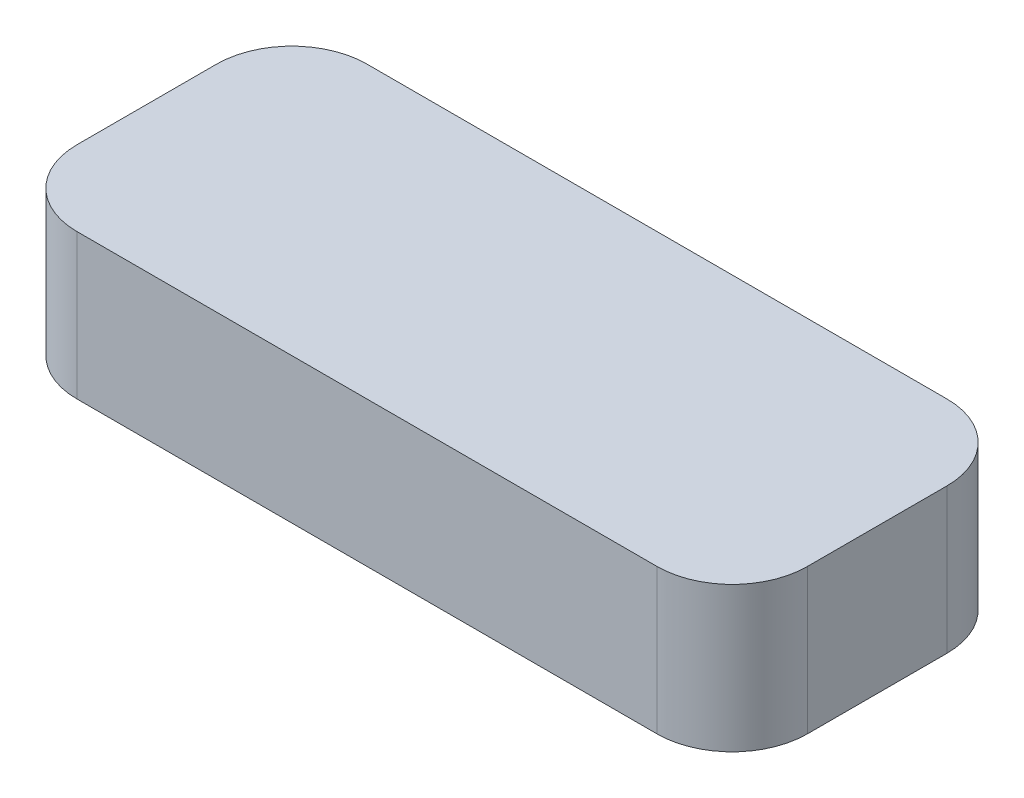
ISO-10303-21;
HEADER;
FILE_DESCRIPTION(('STEP AP214'),'2;1');
FILE_NAME('part.step','',(''),(''),'','','');
FILE_SCHEMA(('AUTOMOTIVE_DESIGN { 1 0 10303 214 1 1 1 1 }'));
ENDSEC;
DATA;
#1=APPLICATION_CONTEXT('core data for automotive mechanical design processes');
#2=APPLICATION_PROTOCOL_DEFINITION('international standard','automotive_design',2000,#1);
#3=PRODUCT_CONTEXT('',#1,'mechanical');
#4=PRODUCT('Part','Part','',(#3));
#5=PRODUCT_RELATED_PRODUCT_CATEGORY('part','',(#4));
#6=PRODUCT_DEFINITION_FORMATION('','',#4);
#7=PRODUCT_DEFINITION_CONTEXT('part definition',#1,'design');
#8=PRODUCT_DEFINITION('design','',#6,#7);
#9=PRODUCT_DEFINITION_SHAPE('','',#8);
#10=(LENGTH_UNIT() NAMED_UNIT(*) SI_UNIT(.MILLI.,.METRE.));
#11=(NAMED_UNIT(*) PLANE_ANGLE_UNIT() SI_UNIT($,.RADIAN.));
#12=(NAMED_UNIT(*) SI_UNIT($,.STERADIAN.) SOLID_ANGLE_UNIT());
#13=UNCERTAINTY_MEASURE_WITH_UNIT(LENGTH_MEASURE(1.E-05),#10,'distance_accuracy_value','');
#14=(GEOMETRIC_REPRESENTATION_CONTEXT(3) GLOBAL_UNCERTAINTY_ASSIGNED_CONTEXT((#13)) GLOBAL_UNIT_ASSIGNED_CONTEXT((#10,
#11,#12)) REPRESENTATION_CONTEXT('',''));
#15=CARTESIAN_POINT('',(0.,0.,0.));
#16=DIRECTION('',(0.,0.,1.));
#17=DIRECTION('',(1.,0.,0.));
#18=AXIS2_PLACEMENT_3D('',#15,#16,#17);
#19=CARTESIAN_POINT('',(215.9,85.725,85.725));
#20=DIRECTION('',(-1.,0.,0.));
#21=DIRECTION('',(0.,0.,1.));
#22=AXIS2_PLACEMENT_3D('',#19,#20,#21);
#23=PLANE('',#22);
#24=DIRECTION('',(0.,0.,-1.));
#25=VECTOR('',#24,1.);
#26=CARTESIAN_POINT('',(215.9,0.,85.725));
#27=LINE('',#26,#25);
#28=CARTESIAN_POINT('',(215.9,0.,41.275));
#29=VERTEX_POINT('',#28);
#30=CARTESIAN_POINT('',(215.9,0.,-41.275));
#31=VERTEX_POINT('',#30);
#32=EDGE_CURVE('E232',#29,#31,#27,.T.);
#33=ORIENTED_EDGE('',*,*,#32,.T.);
#34=DIRECTION('',(0.,-1.,0.));
#35=VECTOR('',#34,1.);
#36=CARTESIAN_POINT('',(215.9,85.725,-41.275));
#37=LINE('',#36,#35);
#38=CARTESIAN_POINT('',(215.9,85.725,-41.275));
#39=VERTEX_POINT('',#38);
#40=EDGE_CURVE('E285',#31,#39,#37,.F.);
#41=ORIENTED_EDGE('',*,*,#40,.T.);
#42=DIRECTION('',(0.,0.,-1.));
#43=VECTOR('',#42,1.);
#44=CARTESIAN_POINT('',(215.9,85.725,85.725));
#45=LINE('',#44,#43);
#46=CARTESIAN_POINT('',(215.9,85.725,41.275));
#47=VERTEX_POINT('',#46);
#48=EDGE_CURVE('E234',#47,#39,#45,.T.);
#49=ORIENTED_EDGE('',*,*,#48,.F.);
#50=DIRECTION('',(0.,-1.,0.));
#51=VECTOR('',#50,1.);
#52=CARTESIAN_POINT('',(215.9,85.725,41.275));
#53=LINE('',#52,#51);
#54=EDGE_CURVE('E281',#47,#29,#53,.T.);
#55=ORIENTED_EDGE('',*,*,#54,.T.);
#56=EDGE_LOOP('',(#33,#41,#49,#55));
#57=FACE_BOUND('',#56,.T.);
#58=ADVANCED_FACE('F42',(#57),#23,.F.);
#59=CARTESIAN_POINT('',(-215.9,85.725,-85.725));
#60=DIRECTION('',(0.,0.,1.));
#61=DIRECTION('',(1.,0.,0.));
#62=AXIS2_PLACEMENT_3D('',#59,#60,#61);
#63=PLANE('',#62);
#64=DIRECTION('',(-1.,0.,0.));
#65=VECTOR('',#64,1.);
#66=CARTESIAN_POINT('',(-215.9,85.725,-85.725));
#67=LINE('',#66,#65);
#68=CARTESIAN_POINT('',(171.45,85.725,-85.725));
#69=VERTEX_POINT('',#68);
#70=CARTESIAN_POINT('',(-171.45,85.725,-85.725));
#71=VERTEX_POINT('',#70);
#72=EDGE_CURVE('E238',#69,#71,#67,.T.);
#73=ORIENTED_EDGE('',*,*,#72,.F.);
#74=DIRECTION('',(0.,-1.,0.));
#75=VECTOR('',#74,1.);
#76=CARTESIAN_POINT('',(171.45,85.725,-85.725));
#77=LINE('',#76,#75);
#78=CARTESIAN_POINT('',(171.45,0.,-85.725));
#79=VERTEX_POINT('',#78);
#80=EDGE_CURVE('E265',#69,#79,#77,.T.);
#81=ORIENTED_EDGE('',*,*,#80,.T.);
#82=DIRECTION('',(-1.,0.,0.));
#83=VECTOR('',#82,1.);
#84=CARTESIAN_POINT('',(-215.9,0.,-85.725));
#85=LINE('',#84,#83);
#86=CARTESIAN_POINT('',(-171.45,0.,-85.725));
#87=VERTEX_POINT('',#86);
#88=EDGE_CURVE('E253',#79,#87,#85,.T.);
#89=ORIENTED_EDGE('',*,*,#88,.T.);
#90=DIRECTION('',(0.,-1.,0.));
#91=VECTOR('',#90,1.);
#92=CARTESIAN_POINT('',(-171.45,85.725,-85.725));
#93=LINE('',#92,#91);
#94=EDGE_CURVE('E249',#87,#71,#93,.F.);
#95=ORIENTED_EDGE('',*,*,#94,.T.);
#96=EDGE_LOOP('',(#73,#81,#89,#95));
#97=FACE_BOUND('',#96,.T.);
#98=ADVANCED_FACE('F336',(#97),#63,.F.);
#99=CARTESIAN_POINT('',(-215.9,85.725,85.725));
#100=DIRECTION('',(1.,0.,0.));
#101=DIRECTION('',(0.,0.,-1.));
#102=AXIS2_PLACEMENT_3D('',#99,#100,#101);
#103=PLANE('',#102);
#104=DIRECTION('',(0.,0.,1.));
#105=VECTOR('',#104,1.);
#106=CARTESIAN_POINT('',(-215.9,0.,85.725));
#107=LINE('',#106,#105);
#108=CARTESIAN_POINT('',(-215.9,0.,-41.275));
#109=VERTEX_POINT('',#108);
#110=CARTESIAN_POINT('',(-215.9,0.,41.275));
#111=VERTEX_POINT('',#110);
#112=EDGE_CURVE('E257',#109,#111,#107,.T.);
#113=ORIENTED_EDGE('',*,*,#112,.T.);
#114=DIRECTION('',(0.,-1.,0.));
#115=VECTOR('',#114,1.);
#116=CARTESIAN_POINT('',(-215.9,85.725,41.275));
#117=LINE('',#116,#115);
#118=CARTESIAN_POINT('',(-215.9,85.725,41.275));
#119=VERTEX_POINT('',#118);
#120=EDGE_CURVE('E12',#111,#119,#117,.F.);
#121=ORIENTED_EDGE('',*,*,#120,.T.);
#122=DIRECTION('',(0.,0.,1.));
#123=VECTOR('',#122,1.);
#124=CARTESIAN_POINT('',(-215.9,85.725,85.725));
#125=LINE('',#124,#123);
#126=CARTESIAN_POINT('',(-215.9,85.725,-41.275));
#127=VERTEX_POINT('',#126);
#128=EDGE_CURVE('E243',#127,#119,#125,.T.);
#129=ORIENTED_EDGE('',*,*,#128,.F.);
#130=DIRECTION('',(0.,-1.,0.));
#131=VECTOR('',#130,1.);
#132=CARTESIAN_POINT('',(-215.9,85.725,-41.275));
#133=LINE('',#132,#131);
#134=EDGE_CURVE('E51',#127,#109,#133,.T.);
#135=ORIENTED_EDGE('',*,*,#134,.T.);
#136=EDGE_LOOP('',(#113,#121,#129,#135));
#137=FACE_BOUND('',#136,.T.);
#138=ADVANCED_FACE('F311',(#137),#103,.F.);
#139=CARTESIAN_POINT('',(-215.9,85.725,85.725));
#140=DIRECTION('',(0.,0.,-1.));
#141=DIRECTION('',(-1.,0.,0.));
#142=AXIS2_PLACEMENT_3D('',#139,#140,#141);
#143=PLANE('',#142);
#144=DIRECTION('',(1.,0.,0.));
#145=VECTOR('',#144,1.);
#146=CARTESIAN_POINT('',(-215.9,0.,85.725));
#147=LINE('',#146,#145);
#148=CARTESIAN_POINT('',(-171.45,0.,85.725));
#149=VERTEX_POINT('',#148);
#150=CARTESIAN_POINT('',(171.45,0.,85.725));
#151=VERTEX_POINT('',#150);
#152=EDGE_CURVE('E239',#149,#151,#147,.T.);
#153=ORIENTED_EDGE('',*,*,#152,.T.);
#154=DIRECTION('',(0.,-1.,0.));
#155=VECTOR('',#154,1.);
#156=CARTESIAN_POINT('',(171.45,85.725,85.725));
#157=LINE('',#156,#155);
#158=CARTESIAN_POINT('',(171.45,85.725,85.725));
#159=VERTEX_POINT('',#158);
#160=EDGE_CURVE('E58',#151,#159,#157,.F.);
#161=ORIENTED_EDGE('',*,*,#160,.T.);
#162=DIRECTION('',(1.,0.,0.));
#163=VECTOR('',#162,1.);
#164=CARTESIAN_POINT('',(-215.9,85.725,85.725));
#165=LINE('',#164,#163);
#166=CARTESIAN_POINT('',(-171.45,85.725,85.725));
#167=VERTEX_POINT('',#166);
#168=EDGE_CURVE('E246',#167,#159,#165,.T.);
#169=ORIENTED_EDGE('',*,*,#168,.F.);
#170=DIRECTION('',(0.,-1.,0.));
#171=VECTOR('',#170,1.);
#172=CARTESIAN_POINT('',(-171.45,85.725,85.725));
#173=LINE('',#172,#171);
#174=EDGE_CURVE('E299',#167,#149,#173,.T.);
#175=ORIENTED_EDGE('',*,*,#174,.T.);
#176=EDGE_LOOP('',(#153,#161,#169,#175));
#177=FACE_BOUND('',#176,.T.);
#178=ADVANCED_FACE('F320',(#177),#143,.F.);
#179=CARTESIAN_POINT('',(0.,85.725,0.));
#180=DIRECTION('',(0.,-1.,0.));
#181=DIRECTION('',(0.,0.,-1.));
#182=AXIS2_PLACEMENT_3D('',#179,#180,#181);
#183=PLANE('',#182);
#184=ORIENTED_EDGE('',*,*,#48,.T.);
#185=CARTESIAN_POINT('',(171.45,85.725,-41.275));
#186=DIRECTION('',(0.,-1.,0.));
#187=DIRECTION('',(0.,0.,-1.));
#188=AXIS2_PLACEMENT_3D('',#185,#186,#187);
#189=CIRCLE('',#188,44.45);
#190=EDGE_CURVE('E296',#39,#69,#189,.F.);
#191=ORIENTED_EDGE('',*,*,#190,.T.);
#192=ORIENTED_EDGE('',*,*,#72,.T.);
#193=CARTESIAN_POINT('',(-171.45,85.725,-41.275));
#194=DIRECTION('',(0.,-1.,0.));
#195=DIRECTION('',(0.,0.,-1.));
#196=AXIS2_PLACEMENT_3D('',#193,#194,#195);
#197=CIRCLE('',#196,44.45);
#198=EDGE_CURVE('E288',#71,#127,#197,.F.);
#199=ORIENTED_EDGE('',*,*,#198,.T.);
#200=ORIENTED_EDGE('',*,*,#128,.T.);
#201=CARTESIAN_POINT('',(-171.45,85.725,41.275));
#202=DIRECTION('',(0.,-1.,0.));
#203=DIRECTION('',(0.,0.,-1.));
#204=AXIS2_PLACEMENT_3D('',#201,#202,#203);
#205=CIRCLE('',#204,44.45);
#206=EDGE_CURVE('E65',#119,#167,#205,.F.);
#207=ORIENTED_EDGE('',*,*,#206,.T.);
#208=ORIENTED_EDGE('',*,*,#168,.T.);
#209=CARTESIAN_POINT('',(171.45,85.725,41.275));
#210=DIRECTION('',(0.,-1.,0.));
#211=DIRECTION('',(0.,0.,-1.));
#212=AXIS2_PLACEMENT_3D('',#209,#210,#211);
#213=CIRCLE('',#212,44.45);
#214=EDGE_CURVE('E293',#159,#47,#213,.F.);
#215=ORIENTED_EDGE('',*,*,#214,.T.);
#216=EDGE_LOOP('',(#184,#191,#192,#199,#200,#207,#208,#215));
#217=FACE_BOUND('',#216,.T.);
#218=ADVANCED_FACE('F322',(#217),#183,.F.);
#219=CARTESIAN_POINT('',(0.,0.,0.));
#220=DIRECTION('',(0.,-1.,0.));
#221=DIRECTION('',(0.,0.,-1.));
#222=AXIS2_PLACEMENT_3D('',#219,#220,#221);
#223=PLANE('',#222);
#224=DIRECTION('',(-1.,0.,0.));
#225=VECTOR('',#224,1.);
#226=CARTESIAN_POINT('',(162.168856379573,0.,76.6864343805733));
#227=LINE('',#226,#225);
#228=CARTESIAN_POINT('',(162.168856379573,0.,76.6864343805733));
#229=VERTEX_POINT('',#228);
#230=CARTESIAN_POINT('',(-162.168856379573,0.,76.6864343805733));
#231=VERTEX_POINT('',#230);
#232=EDGE_CURVE('E180',#229,#231,#227,.T.);
#233=ORIENTED_EDGE('',*,*,#232,.F.);
#234=CARTESIAN_POINT('',(162.168856379573,0.,31.9938563795733));
#235=DIRECTION('',(0.,1.,0.));
#236=DIRECTION('',(0.,0.,1.));
#237=AXIS2_PLACEMENT_3D('',#234,#235,#236);
#238=CIRCLE('',#237,44.692578001);
#239=CARTESIAN_POINT('',(206.861434380573,0.,31.9938563795733));
#240=VERTEX_POINT('',#239);
#241=EDGE_CURVE('E206',#229,#240,#238,.T.);
#242=ORIENTED_EDGE('',*,*,#241,.T.);
#243=DIRECTION('',(0.,0.,1.));
#244=VECTOR('',#243,1.);
#245=CARTESIAN_POINT('',(206.861434380573,0.,-31.9938563795733));
#246=LINE('',#245,#244);
#247=CARTESIAN_POINT('',(206.861434380573,0.,-31.9938563795733));
#248=VERTEX_POINT('',#247);
#249=EDGE_CURVE('E202',#248,#240,#246,.T.);
#250=ORIENTED_EDGE('',*,*,#249,.F.);
#251=CARTESIAN_POINT('',(162.168856379573,0.,-31.9938563795733));
#252=DIRECTION('',(0.,1.,0.));
#253=DIRECTION('',(0.,0.,1.));
#254=AXIS2_PLACEMENT_3D('',#251,#252,#253);
#255=CIRCLE('',#254,44.692578001);
#256=CARTESIAN_POINT('',(162.168856379573,0.,-76.6864343805733));
#257=VERTEX_POINT('',#256);
#258=EDGE_CURVE('E198',#248,#257,#255,.T.);
#259=ORIENTED_EDGE('',*,*,#258,.T.);
#260=DIRECTION('',(1.,0.,0.));
#261=VECTOR('',#260,1.);
#262=CARTESIAN_POINT('',(-162.168856379573,0.,-76.6864343805733));
#263=LINE('',#262,#261);
#264=CARTESIAN_POINT('',(-162.168856379573,0.,-76.6864343805733));
#265=VERTEX_POINT('',#264);
#266=EDGE_CURVE('E191',#265,#257,#263,.T.);
#267=ORIENTED_EDGE('',*,*,#266,.F.);
#268=CARTESIAN_POINT('',(-162.168856379573,0.,-31.9938563795733));
#269=DIRECTION('',(0.,1.,0.));
#270=DIRECTION('',(0.,0.,1.));
#271=AXIS2_PLACEMENT_3D('',#268,#269,#270);
#272=CIRCLE('',#271,44.692578001);
#273=CARTESIAN_POINT('',(-206.861434380573,0.,-31.9938563795733));
#274=VERTEX_POINT('',#273);
#275=EDGE_CURVE('E186',#265,#274,#272,.T.);
#276=ORIENTED_EDGE('',*,*,#275,.T.);
#277=DIRECTION('',(0.,0.,-1.));
#278=VECTOR('',#277,1.);
#279=CARTESIAN_POINT('',(-206.861434380573,0.,31.9938563795733));
#280=LINE('',#279,#278);
#281=CARTESIAN_POINT('',(-206.861434380573,0.,31.9938563795733));
#282=VERTEX_POINT('',#281);
#283=EDGE_CURVE('E162',#282,#274,#280,.T.);
#284=ORIENTED_EDGE('',*,*,#283,.F.);
#285=CARTESIAN_POINT('',(-162.168856379573,0.,31.9938563795733));
#286=DIRECTION('',(0.,-1.,0.));
#287=DIRECTION('',(0.,0.,-1.));
#288=AXIS2_PLACEMENT_3D('',#285,#286,#287);
#289=CIRCLE('',#288,44.692578001);
#290=EDGE_CURVE('E174',#231,#282,#289,.T.);
#291=ORIENTED_EDGE('',*,*,#290,.F.);
#292=EDGE_LOOP('',(#233,#242,#250,#259,#267,#276,#284,#291));
#293=FACE_BOUND('',#292,.T.);
#294=ORIENTED_EDGE('',*,*,#88,.F.);
#295=CARTESIAN_POINT('',(171.45,0.,-41.275));
#296=DIRECTION('',(0.,-1.,0.));
#297=DIRECTION('',(0.,0.,-1.));
#298=AXIS2_PLACEMENT_3D('',#295,#296,#297);
#299=CIRCLE('',#298,44.45);
#300=EDGE_CURVE('E278',#79,#31,#299,.T.);
#301=ORIENTED_EDGE('',*,*,#300,.T.);
#302=ORIENTED_EDGE('',*,*,#32,.F.);
#303=CARTESIAN_POINT('',(171.45,0.,41.275));
#304=DIRECTION('',(0.,-1.,0.));
#305=DIRECTION('',(0.,0.,-1.));
#306=AXIS2_PLACEMENT_3D('',#303,#304,#305);
#307=CIRCLE('',#306,44.45);
#308=EDGE_CURVE('E275',#29,#151,#307,.T.);
#309=ORIENTED_EDGE('',*,*,#308,.T.);
#310=ORIENTED_EDGE('',*,*,#152,.F.);
#311=CARTESIAN_POINT('',(-171.45,0.,41.275));
#312=DIRECTION('',(0.,-1.,0.));
#313=DIRECTION('',(0.,0.,-1.));
#314=AXIS2_PLACEMENT_3D('',#311,#312,#313);
#315=CIRCLE('',#314,44.45);
#316=EDGE_CURVE('E272',#149,#111,#315,.T.);
#317=ORIENTED_EDGE('',*,*,#316,.T.);
#318=ORIENTED_EDGE('',*,*,#112,.F.);
#319=CARTESIAN_POINT('',(-171.45,0.,-41.275));
#320=DIRECTION('',(0.,-1.,0.));
#321=DIRECTION('',(0.,0.,-1.));
#322=AXIS2_PLACEMENT_3D('',#319,#320,#321);
#323=CIRCLE('',#322,44.45);
#324=EDGE_CURVE('E269',#109,#87,#323,.T.);
#325=ORIENTED_EDGE('',*,*,#324,.T.);
#326=EDGE_LOOP('',(#294,#301,#302,#309,#310,#317,#318,#325));
#327=FACE_BOUND('',#326,.T.);
#328=ADVANCED_FACE('F182',(#293,#327),#223,.T.);
#329=CARTESIAN_POINT('',(162.168856379573,526.961726721583,76.6864343805733));
#330=DIRECTION('',(0.,0.,1.));
#331=DIRECTION('',(1.,0.,0.));
#332=AXIS2_PLACEMENT_3D('',#329,#330,#331);
#333=PLANE('',#332);
#334=DIRECTION('',(1.,0.,0.));
#335=VECTOR('',#334,1.);
#336=CARTESIAN_POINT('',(162.168856379573,73.025,76.6864343805733));
#337=LINE('',#336,#335);
#338=CARTESIAN_POINT('',(-162.168856379573,73.025,76.6864343805733));
#339=VERTEX_POINT('',#338);
#340=CARTESIAN_POINT('',(162.168856379573,73.025,76.6864343805733));
#341=VERTEX_POINT('',#340);
#342=EDGE_CURVE('E233',#339,#341,#337,.T.);
#343=ORIENTED_EDGE('',*,*,#342,.T.);
#344=DIRECTION('',(0.,-1.,0.));
#345=VECTOR('',#344,1.);
#346=CARTESIAN_POINT('',(162.168856379573,526.961726721583,76.6864343805733));
#347=LINE('',#346,#345);
#348=EDGE_CURVE('E210',#341,#229,#347,.T.);
#349=ORIENTED_EDGE('',*,*,#348,.T.);
#350=ORIENTED_EDGE('',*,*,#232,.T.);
#351=DIRECTION('',(0.,-1.,0.));
#352=VECTOR('',#351,1.);
#353=CARTESIAN_POINT('',(-162.168856379573,526.961726721583,76.6864343805733));
#354=LINE('',#353,#352);
#355=EDGE_CURVE('E170',#339,#231,#354,.T.);
#356=ORIENTED_EDGE('',*,*,#355,.F.);
#357=EDGE_LOOP('',(#343,#349,#350,#356));
#358=FACE_BOUND('',#357,.T.);
#359=ADVANCED_FACE('F380',(#358),#333,.F.);
#360=CARTESIAN_POINT('',(162.168856379573,526.961726721583,31.9938563795733));
#361=DIRECTION('',(0.,-1.,0.));
#362=DIRECTION('',(0.,0.,-1.));
#363=AXIS2_PLACEMENT_3D('',#360,#361,#362);
#364=CYLINDRICAL_SURFACE('',#363,44.692578001);
#365=DIRECTION('',(0.,-1.,0.));
#366=VECTOR('',#365,1.);
#367=CARTESIAN_POINT('',(206.861434380573,526.961726721583,31.9938563795733));
#368=LINE('',#367,#366);
#369=CARTESIAN_POINT('',(206.861434380573,73.025,31.9938563795733));
#370=VERTEX_POINT('',#369);
#371=EDGE_CURVE('E213',#370,#240,#368,.T.);
#372=ORIENTED_EDGE('',*,*,#371,.T.);
#373=ORIENTED_EDGE('',*,*,#241,.F.);
#374=ORIENTED_EDGE('',*,*,#348,.F.);
#375=CARTESIAN_POINT('',(162.168856379573,73.025,31.9938563795733));
#376=DIRECTION('',(0.,-1.,0.));
#377=DIRECTION('',(0.,0.,-1.));
#378=AXIS2_PLACEMENT_3D('',#375,#376,#377);
#379=CIRCLE('',#378,44.692578001);
#380=EDGE_CURVE('E572',#370,#341,#379,.T.);
#381=ORIENTED_EDGE('',*,*,#380,.F.);
#382=EDGE_LOOP('',(#372,#373,#374,#381));
#383=FACE_BOUND('',#382,.T.);
#384=ADVANCED_FACE('F432',(#383),#364,.F.);
#385=CARTESIAN_POINT('',(206.861434380573,526.961726721583,-31.9938563795733));
#386=DIRECTION('',(1.,0.,0.));
#387=DIRECTION('',(0.,0.,-1.));
#388=AXIS2_PLACEMENT_3D('',#385,#386,#387);
#389=PLANE('',#388);
#390=DIRECTION('',(0.,0.,-1.));
#391=VECTOR('',#390,1.);
#392=CARTESIAN_POINT('',(206.861434380573,73.025,-31.9938563795733));
#393=LINE('',#392,#391);
#394=CARTESIAN_POINT('',(206.861434380573,73.025,-31.9938563795733));
#395=VERTEX_POINT('',#394);
#396=EDGE_CURVE('E582',#370,#395,#393,.T.);
#397=ORIENTED_EDGE('',*,*,#396,.T.);
#398=DIRECTION('',(0.,-1.,0.));
#399=VECTOR('',#398,1.);
#400=CARTESIAN_POINT('',(206.861434380573,526.961726721583,-31.9938563795733));
#401=LINE('',#400,#399);
#402=EDGE_CURVE('E216',#395,#248,#401,.T.);
#403=ORIENTED_EDGE('',*,*,#402,.T.);
#404=ORIENTED_EDGE('',*,*,#249,.T.);
#405=ORIENTED_EDGE('',*,*,#371,.F.);
#406=EDGE_LOOP('',(#397,#403,#404,#405));
#407=FACE_BOUND('',#406,.T.);
#408=ADVANCED_FACE('F440',(#407),#389,.F.);
#409=CARTESIAN_POINT('',(162.168856379573,526.961726721583,-31.9938563795733));
#410=DIRECTION('',(0.,-1.,0.));
#411=DIRECTION('',(0.,0.,-1.));
#412=AXIS2_PLACEMENT_3D('',#409,#410,#411);
#413=CYLINDRICAL_SURFACE('',#412,44.692578001);
#414=DIRECTION('',(0.,-1.,0.));
#415=VECTOR('',#414,1.);
#416=CARTESIAN_POINT('',(162.168856379573,526.961726721583,-76.6864343805733));
#417=LINE('',#416,#415);
#418=CARTESIAN_POINT('',(162.168856379573,73.025,-76.6864343805733));
#419=VERTEX_POINT('',#418);
#420=EDGE_CURVE('E219',#419,#257,#417,.T.);
#421=ORIENTED_EDGE('',*,*,#420,.T.);
#422=ORIENTED_EDGE('',*,*,#258,.F.);
#423=ORIENTED_EDGE('',*,*,#402,.F.);
#424=CARTESIAN_POINT('',(162.168856379573,73.025,-31.9938563795733));
#425=DIRECTION('',(0.,-1.,0.));
#426=DIRECTION('',(0.,0.,-1.));
#427=AXIS2_PLACEMENT_3D('',#424,#425,#426);
#428=CIRCLE('',#427,44.692578001);
#429=EDGE_CURVE('E585',#419,#395,#428,.T.);
#430=ORIENTED_EDGE('',*,*,#429,.F.);
#431=EDGE_LOOP('',(#421,#422,#423,#430));
#432=FACE_BOUND('',#431,.T.);
#433=ADVANCED_FACE('F448',(#432),#413,.F.);
#434=CARTESIAN_POINT('',(-162.168856379573,526.961726721583,-76.6864343805733));
#435=DIRECTION('',(0.,0.,-1.));
#436=DIRECTION('',(-1.,0.,0.));
#437=AXIS2_PLACEMENT_3D('',#434,#435,#436);
#438=PLANE('',#437);
#439=DIRECTION('',(-1.,0.,0.));
#440=VECTOR('',#439,1.);
#441=CARTESIAN_POINT('',(-162.168856379573,73.025,-76.6864343805733));
#442=LINE('',#441,#440);
#443=CARTESIAN_POINT('',(-162.168856379573,73.025,-76.6864343805733));
#444=VERTEX_POINT('',#443);
#445=EDGE_CURVE('E589',#419,#444,#442,.T.);
#446=ORIENTED_EDGE('',*,*,#445,.T.);
#447=DIRECTION('',(0.,-1.,0.));
#448=VECTOR('',#447,1.);
#449=CARTESIAN_POINT('',(-162.168856379573,526.961726721583,-76.6864343805733));
#450=LINE('',#449,#448);
#451=EDGE_CURVE('E222',#444,#265,#450,.T.);
#452=ORIENTED_EDGE('',*,*,#451,.T.);
#453=ORIENTED_EDGE('',*,*,#266,.T.);
#454=ORIENTED_EDGE('',*,*,#420,.F.);
#455=EDGE_LOOP('',(#446,#452,#453,#454));
#456=FACE_BOUND('',#455,.T.);
#457=ADVANCED_FACE('F456',(#456),#438,.F.);
#458=CARTESIAN_POINT('',(-162.168856379573,526.961726721583,-31.9938563795733));
#459=DIRECTION('',(0.,-1.,0.));
#460=DIRECTION('',(0.,0.,-1.));
#461=AXIS2_PLACEMENT_3D('',#458,#459,#460);
#462=CYLINDRICAL_SURFACE('',#461,44.692578001);
#463=DIRECTION('',(0.,-1.,0.));
#464=VECTOR('',#463,1.);
#465=CARTESIAN_POINT('',(-206.861434380573,526.961726721583,-31.9938563795733));
#466=LINE('',#465,#464);
#467=CARTESIAN_POINT('',(-206.861434380573,73.025,-31.9938563795733));
#468=VERTEX_POINT('',#467);
#469=EDGE_CURVE('E169',#468,#274,#466,.T.);
#470=ORIENTED_EDGE('',*,*,#469,.T.);
#471=ORIENTED_EDGE('',*,*,#275,.F.);
#472=ORIENTED_EDGE('',*,*,#451,.F.);
#473=CARTESIAN_POINT('',(-162.168856379573,73.025,-31.9938563795733));
#474=DIRECTION('',(0.,-1.,0.));
#475=DIRECTION('',(0.,0.,-1.));
#476=AXIS2_PLACEMENT_3D('',#473,#474,#475);
#477=CIRCLE('',#476,44.692578001);
#478=EDGE_CURVE('E592',#468,#444,#477,.T.);
#479=ORIENTED_EDGE('',*,*,#478,.F.);
#480=EDGE_LOOP('',(#470,#471,#472,#479));
#481=FACE_BOUND('',#480,.T.);
#482=ADVANCED_FACE('F464',(#481),#462,.F.);
#483=CARTESIAN_POINT('',(-206.861434380573,526.961726721583,31.9938563795733));
#484=DIRECTION('',(-1.,0.,0.));
#485=DIRECTION('',(0.,0.,1.));
#486=AXIS2_PLACEMENT_3D('',#483,#484,#485);
#487=PLANE('',#486);
#488=DIRECTION('',(0.,0.,1.));
#489=VECTOR('',#488,1.);
#490=CARTESIAN_POINT('',(-206.861434380573,73.025,31.9938563795733));
#491=LINE('',#490,#489);
#492=CARTESIAN_POINT('',(-206.861434380573,73.025,31.9938563795733));
#493=VERTEX_POINT('',#492);
#494=EDGE_CURVE('E165',#468,#493,#491,.T.);
#495=ORIENTED_EDGE('',*,*,#494,.T.);
#496=DIRECTION('',(0.,-1.,0.));
#497=VECTOR('',#496,1.);
#498=CARTESIAN_POINT('',(-206.861434380573,526.961726721583,31.9938563795733));
#499=LINE('',#498,#497);
#500=EDGE_CURVE('E157',#493,#282,#499,.T.);
#501=ORIENTED_EDGE('',*,*,#500,.T.);
#502=ORIENTED_EDGE('',*,*,#283,.T.);
#503=ORIENTED_EDGE('',*,*,#469,.F.);
#504=EDGE_LOOP('',(#495,#501,#502,#503));
#505=FACE_BOUND('',#504,.T.);
#506=ADVANCED_FACE('F159',(#505),#487,.F.);
#507=CARTESIAN_POINT('',(-162.168856379573,526.961726721583,31.9938563795733));
#508=DIRECTION('',(0.,-1.,0.));
#509=DIRECTION('',(0.,0.,-1.));
#510=AXIS2_PLACEMENT_3D('',#507,#508,#509);
#511=CYLINDRICAL_SURFACE('',#510,44.692578001);
#512=CARTESIAN_POINT('',(-162.168856379573,73.025,31.9938563795733));
#513=DIRECTION('',(0.,-1.,0.));
#514=DIRECTION('',(0.,0.,-1.));
#515=AXIS2_PLACEMENT_3D('',#512,#513,#514);
#516=CIRCLE('',#515,44.692578001);
#517=EDGE_CURVE('E229',#493,#339,#516,.F.);
#518=ORIENTED_EDGE('',*,*,#517,.T.);
#519=ORIENTED_EDGE('',*,*,#355,.T.);
#520=ORIENTED_EDGE('',*,*,#290,.T.);
#521=ORIENTED_EDGE('',*,*,#500,.F.);
#522=EDGE_LOOP('',(#518,#519,#520,#521));
#523=FACE_BOUND('',#522,.T.);
#524=ADVANCED_FACE('F175',(#523),#511,.F.);
#525=CARTESIAN_POINT('',(0.,73.025,0.));
#526=DIRECTION('',(0.,-1.,0.));
#527=DIRECTION('',(0.,0.,-1.));
#528=AXIS2_PLACEMENT_3D('',#525,#526,#527);
#529=PLANE('',#528);
#530=ORIENTED_EDGE('',*,*,#342,.F.);
#531=ORIENTED_EDGE('',*,*,#517,.F.);
#532=ORIENTED_EDGE('',*,*,#494,.F.);
#533=ORIENTED_EDGE('',*,*,#478,.T.);
#534=ORIENTED_EDGE('',*,*,#445,.F.);
#535=ORIENTED_EDGE('',*,*,#429,.T.);
#536=ORIENTED_EDGE('',*,*,#396,.F.);
#537=ORIENTED_EDGE('',*,*,#380,.T.);
#538=EDGE_LOOP('',(#530,#531,#532,#533,#534,#535,#536,#537));
#539=FACE_BOUND('',#538,.T.);
#540=ADVANCED_FACE('F352',(#539),#529,.T.);
#541=CARTESIAN_POINT('',(171.45,85.725,-41.275));
#542=DIRECTION('',(0.,-1.,0.));
#543=DIRECTION('',(0.,0.,-1.));
#544=AXIS2_PLACEMENT_3D('',#541,#542,#543);
#545=CYLINDRICAL_SURFACE('',#544,44.45);
#546=ORIENTED_EDGE('',*,*,#190,.F.);
#547=ORIENTED_EDGE('',*,*,#40,.F.);
#548=ORIENTED_EDGE('',*,*,#300,.F.);
#549=ORIENTED_EDGE('',*,*,#80,.F.);
#550=EDGE_LOOP('',(#546,#547,#548,#549));
#551=FACE_BOUND('',#550,.T.);
#552=ADVANCED_FACE('F333',(#551),#545,.T.);
#553=CARTESIAN_POINT('',(171.45,85.725,41.275));
#554=DIRECTION('',(0.,-1.,0.));
#555=DIRECTION('',(0.,0.,-1.));
#556=AXIS2_PLACEMENT_3D('',#553,#554,#555);
#557=CYLINDRICAL_SURFACE('',#556,44.45);
#558=ORIENTED_EDGE('',*,*,#214,.F.);
#559=ORIENTED_EDGE('',*,*,#160,.F.);
#560=ORIENTED_EDGE('',*,*,#308,.F.);
#561=ORIENTED_EDGE('',*,*,#54,.F.);
#562=EDGE_LOOP('',(#558,#559,#560,#561));
#563=FACE_BOUND('',#562,.T.);
#564=ADVANCED_FACE('F326',(#563),#557,.T.);
#565=CARTESIAN_POINT('',(-171.45,85.725,41.275));
#566=DIRECTION('',(0.,-1.,0.));
#567=DIRECTION('',(0.,0.,-1.));
#568=AXIS2_PLACEMENT_3D('',#565,#566,#567);
#569=CYLINDRICAL_SURFACE('',#568,44.45);
#570=ORIENTED_EDGE('',*,*,#206,.F.);
#571=ORIENTED_EDGE('',*,*,#120,.F.);
#572=ORIENTED_EDGE('',*,*,#316,.F.);
#573=ORIENTED_EDGE('',*,*,#174,.F.);
#574=EDGE_LOOP('',(#570,#571,#572,#573));
#575=FACE_BOUND('',#574,.T.);
#576=ADVANCED_FACE('F319',(#575),#569,.T.);
#577=CARTESIAN_POINT('',(-171.45,85.725,-41.275));
#578=DIRECTION('',(0.,-1.,0.));
#579=DIRECTION('',(0.,0.,-1.));
#580=AXIS2_PLACEMENT_3D('',#577,#578,#579);
#581=CYLINDRICAL_SURFACE('',#580,44.45);
#582=ORIENTED_EDGE('',*,*,#198,.F.);
#583=ORIENTED_EDGE('',*,*,#94,.F.);
#584=ORIENTED_EDGE('',*,*,#324,.F.);
#585=ORIENTED_EDGE('',*,*,#134,.F.);
#586=EDGE_LOOP('',(#582,#583,#584,#585));
#587=FACE_BOUND('',#586,.T.);
#588=ADVANCED_FACE('F44',(#587),#581,.T.);
#589=CLOSED_SHELL('',(#58,#98,#138,#178,#218,#328,#359,#384,#408,#433,#457,#482,#506,#524,#540,
#552,#564,#576,#588));
#590=MANIFOLD_SOLID_BREP('B2',#589);
#591=ADVANCED_BREP_SHAPE_REPRESENTATION('',(#18,#590),#14);
#592=SHAPE_DEFINITION_REPRESENTATION(#9,#591);
ENDSEC;
END-ISO-10303-21;
